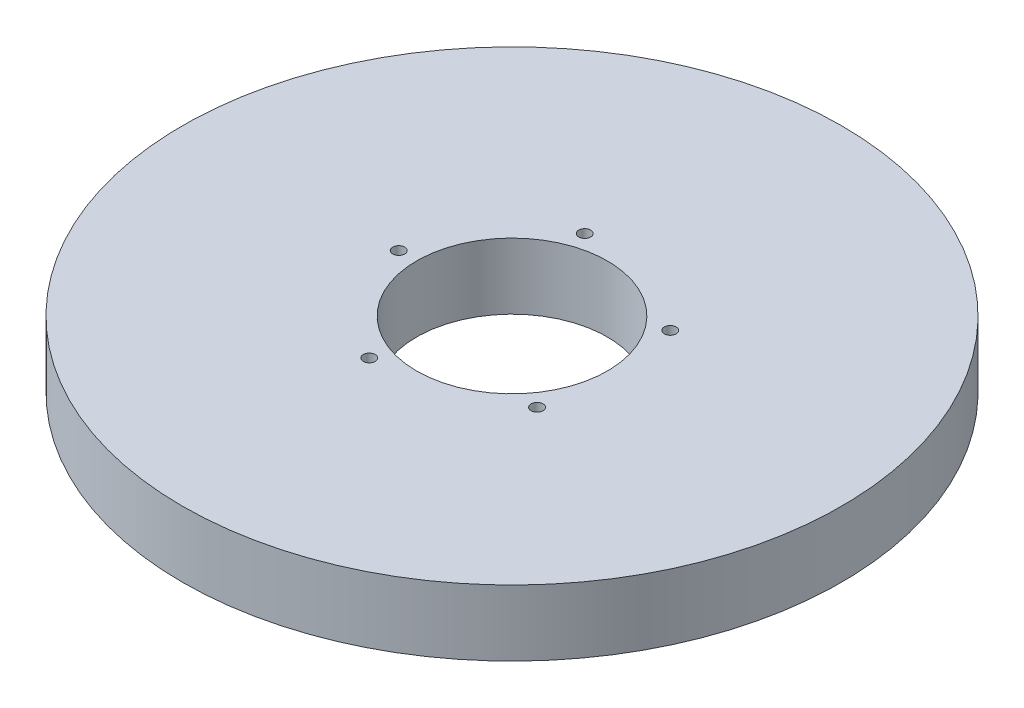
ISO-10303-21;
HEADER;
FILE_DESCRIPTION(('STEP AP214'),'2;1');
FILE_NAME('part.step','',(''),(''),'','','');
FILE_SCHEMA(('AUTOMOTIVE_DESIGN { 1 0 10303 214 1 1 1 1 }'));
ENDSEC;
DATA;
#1=APPLICATION_CONTEXT('core data for automotive mechanical design processes');
#2=APPLICATION_PROTOCOL_DEFINITION('international standard','automotive_design',2000,#1);
#3=PRODUCT_CONTEXT('',#1,'mechanical');
#4=PRODUCT('Part','Part','',(#3));
#5=PRODUCT_RELATED_PRODUCT_CATEGORY('part','',(#4));
#6=PRODUCT_DEFINITION_FORMATION('','',#4);
#7=PRODUCT_DEFINITION_CONTEXT('part definition',#1,'design');
#8=PRODUCT_DEFINITION('design','',#6,#7);
#9=PRODUCT_DEFINITION_SHAPE('','',#8);
#10=(LENGTH_UNIT() NAMED_UNIT(*) SI_UNIT(.MILLI.,.METRE.));
#11=(NAMED_UNIT(*) PLANE_ANGLE_UNIT() SI_UNIT($,.RADIAN.));
#12=(NAMED_UNIT(*) SI_UNIT($,.STERADIAN.) SOLID_ANGLE_UNIT());
#13=UNCERTAINTY_MEASURE_WITH_UNIT(LENGTH_MEASURE(1.E-05),#10,'distance_accuracy_value','');
#14=(GEOMETRIC_REPRESENTATION_CONTEXT(3) GLOBAL_UNCERTAINTY_ASSIGNED_CONTEXT((#13)) GLOBAL_UNIT_ASSIGNED_CONTEXT((#10,
#11,#12)) REPRESENTATION_CONTEXT('',''));
#15=CARTESIAN_POINT('',(0.,0.,0.));
#16=DIRECTION('',(0.,0.,1.));
#17=DIRECTION('',(1.,0.,0.));
#18=AXIS2_PLACEMENT_3D('',#15,#16,#17);
#19=CARTESIAN_POINT('',(0.,19.,0.));
#20=DIRECTION('',(0.,-1.,0.));
#21=DIRECTION('',(0.,0.,-1.));
#22=AXIS2_PLACEMENT_3D('',#19,#20,#21);
#23=CYLINDRICAL_SURFACE('',#22,95.);
#24=CARTESIAN_POINT('',(0.,19.,0.));
#25=DIRECTION('',(0.,1.,0.));
#26=DIRECTION('',(0.,0.,1.));
#27=AXIS2_PLACEMENT_3D('',#24,#25,#26);
#28=CIRCLE('',#27,95.);
#29=CARTESIAN_POINT('',(0.,19.,95.));
#30=VERTEX_POINT('',#29);
#31=EDGE_CURVE('E10',#30,#30,#28,.T.);
#32=ORIENTED_EDGE('',*,*,#31,.F.);
#33=EDGE_LOOP('',(#32));
#34=FACE_BOUND('',#33,.T.);
#35=CARTESIAN_POINT('',(0.,0.,0.));
#36=DIRECTION('',(0.,1.,0.));
#37=DIRECTION('',(0.,0.,1.));
#38=AXIS2_PLACEMENT_3D('',#35,#36,#37);
#39=CIRCLE('',#38,95.);
#40=CARTESIAN_POINT('',(0.,0.,95.));
#41=VERTEX_POINT('',#40);
#42=EDGE_CURVE('E37',#41,#41,#39,.T.);
#43=ORIENTED_EDGE('',*,*,#42,.T.);
#44=EDGE_LOOP('',(#43));
#45=FACE_BOUND('',#44,.T.);
#46=ADVANCED_FACE('F40',(#34,#45),#23,.T.);
#47=CARTESIAN_POINT('',(0.,19.,0.));
#48=DIRECTION('',(0.,1.,0.));
#49=DIRECTION('',(0.,0.,1.));
#50=AXIS2_PLACEMENT_3D('',#47,#48,#49);
#51=PLANE('',#50);
#52=CARTESIAN_POINT('',(-10.091141222785,19.,31.0573392126761));
#53=DIRECTION('',(0.,1.,0.));
#54=DIRECTION('',(0.951056516295155,0.,0.309016994374945));
#55=AXIS2_PLACEMENT_3D('',#52,#53,#54);
#56=CIRCLE('',#55,1.73045322483191);
#57=CARTESIAN_POINT('',(-8.44538240716461,19.,31.5920786671201));
#58=VERTEX_POINT('',#57);
#59=EDGE_CURVE('E78',#58,#58,#56,.T.);
#60=ORIENTED_EDGE('',*,*,#59,.F.);
#61=EDGE_LOOP('',(#60));
#62=FACE_BOUND('',#61,.T.);
#63=CARTESIAN_POINT('',(26.4189507065265,19.,19.1944912335686));
#64=DIRECTION('',(0.,1.,0.));
#65=DIRECTION('',(0.587785252292469,0.,-0.809016994374951));
#66=AXIS2_PLACEMENT_3D('',#63,#64,#65);
#67=CIRCLE('',#66,1.73045322483191);
#68=CARTESIAN_POINT('',(27.4360855918647,19.,17.7945251667086));
#69=VERTEX_POINT('',#68);
#70=EDGE_CURVE('E71',#69,#69,#67,.T.);
#71=ORIENTED_EDGE('',*,*,#70,.F.);
#72=EDGE_LOOP('',(#71));
#73=FACE_BOUND('',#72,.T.);
#74=CARTESIAN_POINT('',(26.4189507065263,19.,-19.194491233569));
#75=DIRECTION('',(0.,1.,0.));
#76=DIRECTION('',(-0.58778525229248,0.,-0.809016994374942));
#77=AXIS2_PLACEMENT_3D('',#74,#75,#76);
#78=CIRCLE('',#77,1.73045322483191);
#79=CARTESIAN_POINT('',(25.4018158211881,19.,-20.5944573004289));
#80=VERTEX_POINT('',#79);
#81=EDGE_CURVE('E70',#80,#80,#78,.T.);
#82=ORIENTED_EDGE('',*,*,#81,.F.);
#83=EDGE_LOOP('',(#82));
#84=FACE_BOUND('',#83,.T.);
#85=CARTESIAN_POINT('',(-10.0911412227854,19.,-31.057339212676));
#86=DIRECTION('',(0.,1.,0.));
#87=DIRECTION('',(-0.95105651629515,0.,0.309016994374958));
#88=AXIS2_PLACEMENT_3D('',#85,#86,#87);
#89=CIRCLE('',#88,1.73045322483191);
#90=CARTESIAN_POINT('',(-11.7369000384057,19.,-30.522599758232));
#91=VERTEX_POINT('',#90);
#92=EDGE_CURVE('E61',#91,#91,#89,.T.);
#93=ORIENTED_EDGE('',*,*,#92,.F.);
#94=EDGE_LOOP('',(#93));
#95=FACE_BOUND('',#94,.T.);
#96=CARTESIAN_POINT('',(-32.6556189674828,19.,0.));
#97=DIRECTION('',(0.,1.,0.));
#98=DIRECTION('',(0.,0.,1.));
#99=AXIS2_PLACEMENT_3D('',#96,#97,#98);
#100=CIRCLE('',#99,1.73045322483191);
#101=CARTESIAN_POINT('',(-32.6556189674828,19.,1.73045322483191));
#102=VERTEX_POINT('',#101);
#103=EDGE_CURVE('E54',#102,#102,#100,.T.);
#104=ORIENTED_EDGE('',*,*,#103,.F.);
#105=EDGE_LOOP('',(#104));
#106=FACE_BOUND('',#105,.T.);
#107=CARTESIAN_POINT('',(0.,19.,0.));
#108=DIRECTION('',(0.,1.,0.));
#109=DIRECTION('',(0.,0.,1.));
#110=AXIS2_PLACEMENT_3D('',#107,#108,#109);
#111=CIRCLE('',#110,27.5);
#112=CARTESIAN_POINT('',(0.,19.,27.5));
#113=VERTEX_POINT('',#112);
#114=EDGE_CURVE('E50',#113,#113,#111,.T.);
#115=ORIENTED_EDGE('',*,*,#114,.F.);
#116=EDGE_LOOP('',(#115));
#117=FACE_BOUND('',#116,.T.);
#118=ORIENTED_EDGE('',*,*,#31,.T.);
#119=EDGE_LOOP('',(#118));
#120=FACE_BOUND('',#119,.T.);
#121=ADVANCED_FACE('F94',(#62,#73,#84,#95,#106,#117,#120),#51,.T.);
#122=CARTESIAN_POINT('',(0.,0.,0.));
#123=DIRECTION('',(0.,1.,0.));
#124=DIRECTION('',(0.,0.,1.));
#125=AXIS2_PLACEMENT_3D('',#122,#123,#124);
#126=PLANE('',#125);
#127=CARTESIAN_POINT('',(0.,0.,0.));
#128=DIRECTION('',(0.,1.,0.));
#129=DIRECTION('',(0.,0.,1.));
#130=AXIS2_PLACEMENT_3D('',#127,#128,#129);
#131=CIRCLE('',#130,27.5);
#132=CARTESIAN_POINT('',(0.,0.,27.5));
#133=VERTEX_POINT('',#132);
#134=EDGE_CURVE('E47',#133,#133,#131,.T.);
#135=ORIENTED_EDGE('',*,*,#134,.T.);
#136=EDGE_LOOP('',(#135));
#137=FACE_BOUND('',#136,.T.);
#138=ORIENTED_EDGE('',*,*,#42,.F.);
#139=EDGE_LOOP('',(#138));
#140=FACE_BOUND('',#139,.T.);
#141=ADVANCED_FACE('F100',(#137,#140),#126,.F.);
#142=CARTESIAN_POINT('',(0.,19.,0.));
#143=DIRECTION('',(0.,-1.,0.));
#144=DIRECTION('',(0.,0.,-1.));
#145=AXIS2_PLACEMENT_3D('',#142,#143,#144);
#146=CYLINDRICAL_SURFACE('',#145,27.5);
#147=ORIENTED_EDGE('',*,*,#114,.T.);
#148=EDGE_LOOP('',(#147));
#149=FACE_BOUND('',#148,.T.);
#150=ORIENTED_EDGE('',*,*,#134,.F.);
#151=EDGE_LOOP('',(#150));
#152=FACE_BOUND('',#151,.T.);
#153=ADVANCED_FACE('F108',(#149,#152),#146,.F.);
#154=CARTESIAN_POINT('',(-32.6556189674828,4.75525767914453,0.));
#155=DIRECTION('',(0.,1.,0.));
#156=DIRECTION('',(0.,0.,1.));
#157=AXIS2_PLACEMENT_3D('',#154,#155,#156);
#158=CYLINDRICAL_SURFACE('',#157,1.73045322483191);
#159=CARTESIAN_POINT('',(-32.6556189674828,4.75525767914453,0.));
#160=DIRECTION('',(0.,1.,0.));
#161=DIRECTION('',(0.,0.,1.));
#162=AXIS2_PLACEMENT_3D('',#159,#160,#161);
#163=CIRCLE('',#162,1.73045322483191);
#164=CARTESIAN_POINT('',(-32.6556189674828,4.75525767914453,1.73045322483191));
#165=VERTEX_POINT('',#164);
#166=EDGE_CURVE('E55',#165,#165,#163,.T.);
#167=ORIENTED_EDGE('',*,*,#166,.F.);
#168=EDGE_LOOP('',(#167));
#169=FACE_BOUND('',#168,.T.);
#170=ORIENTED_EDGE('',*,*,#103,.T.);
#171=EDGE_LOOP('',(#170));
#172=FACE_BOUND('',#171,.T.);
#173=ADVANCED_FACE('F115',(#169,#172),#158,.F.);
#174=CARTESIAN_POINT('',(-32.6556189674828,4.75525767914453,0.));
#175=DIRECTION('',(0.,1.,0.));
#176=DIRECTION('',(0.,0.,1.));
#177=AXIS2_PLACEMENT_3D('',#174,#175,#176);
#178=PLANE('',#177);
#179=ORIENTED_EDGE('',*,*,#166,.T.);
#180=EDGE_LOOP('',(#179));
#181=FACE_BOUND('',#180,.T.);
#182=ADVANCED_FACE('F142',(#181),#178,.T.);
#183=CARTESIAN_POINT('',(-10.0911412227854,4.75525767914453,-31.057339212676));
#184=DIRECTION('',(0.,1.,0.));
#185=DIRECTION('',(0.,0.,1.));
#186=AXIS2_PLACEMENT_3D('',#183,#184,#185);
#187=CYLINDRICAL_SURFACE('',#186,1.73045322483191);
#188=CARTESIAN_POINT('',(-10.0911412227854,4.75525767914453,-31.057339212676));
#189=DIRECTION('',(0.,1.,0.));
#190=DIRECTION('',(-0.95105651629515,0.,0.309016994374958));
#191=AXIS2_PLACEMENT_3D('',#188,#189,#190);
#192=CIRCLE('',#191,1.73045322483191);
#193=CARTESIAN_POINT('',(-11.7369000384057,4.75525767914453,-30.522599758232));
#194=VERTEX_POINT('',#193);
#195=EDGE_CURVE('E63',#194,#194,#192,.T.);
#196=ORIENTED_EDGE('',*,*,#195,.F.);
#197=EDGE_LOOP('',(#196));
#198=FACE_BOUND('',#197,.T.);
#199=ORIENTED_EDGE('',*,*,#92,.T.);
#200=EDGE_LOOP('',(#199));
#201=FACE_BOUND('',#200,.T.);
#202=ADVANCED_FACE('F147',(#198,#201),#187,.F.);
#203=CARTESIAN_POINT('',(-10.0911412227854,4.75525767914453,-31.057339212676));
#204=DIRECTION('',(0.,1.,0.));
#205=DIRECTION('',(-0.95105651629515,0.,0.309016994374958));
#206=AXIS2_PLACEMENT_3D('',#203,#204,#205);
#207=PLANE('',#206);
#208=ORIENTED_EDGE('',*,*,#195,.T.);
#209=EDGE_LOOP('',(#208));
#210=FACE_BOUND('',#209,.T.);
#211=ADVANCED_FACE('F163',(#210),#207,.T.);
#212=CARTESIAN_POINT('',(26.4189507065263,4.75525767914453,-19.194491233569));
#213=DIRECTION('',(0.,1.,0.));
#214=DIRECTION('',(0.,0.,1.));
#215=AXIS2_PLACEMENT_3D('',#212,#213,#214);
#216=CYLINDRICAL_SURFACE('',#215,1.73045322483191);
#217=CARTESIAN_POINT('',(26.4189507065263,4.75525767914453,-19.194491233569));
#218=DIRECTION('',(0.,1.,0.));
#219=DIRECTION('',(-0.58778525229248,0.,-0.809016994374942));
#220=AXIS2_PLACEMENT_3D('',#217,#218,#219);
#221=CIRCLE('',#220,1.73045322483191);
#222=CARTESIAN_POINT('',(25.4018158211881,4.75525767914453,-20.5944573004289));
#223=VERTEX_POINT('',#222);
#224=EDGE_CURVE('E69',#223,#223,#221,.T.);
#225=ORIENTED_EDGE('',*,*,#224,.F.);
#226=EDGE_LOOP('',(#225));
#227=FACE_BOUND('',#226,.T.);
#228=ORIENTED_EDGE('',*,*,#81,.T.);
#229=EDGE_LOOP('',(#228));
#230=FACE_BOUND('',#229,.T.);
#231=ADVANCED_FACE('F172',(#227,#230),#216,.F.);
#232=CARTESIAN_POINT('',(26.4189507065263,4.75525767914453,-19.194491233569));
#233=DIRECTION('',(0.,1.,0.));
#234=DIRECTION('',(-0.58778525229248,0.,-0.809016994374942));
#235=AXIS2_PLACEMENT_3D('',#232,#233,#234);
#236=PLANE('',#235);
#237=ORIENTED_EDGE('',*,*,#224,.T.);
#238=EDGE_LOOP('',(#237));
#239=FACE_BOUND('',#238,.T.);
#240=ADVANCED_FACE('F185',(#239),#236,.T.);
#241=CARTESIAN_POINT('',(26.4189507065265,4.75525767914453,19.1944912335686));
#242=DIRECTION('',(0.,1.,0.));
#243=DIRECTION('',(0.,0.,1.));
#244=AXIS2_PLACEMENT_3D('',#241,#242,#243);
#245=CYLINDRICAL_SURFACE('',#244,1.73045322483191);
#246=CARTESIAN_POINT('',(26.4189507065265,4.75525767914453,19.1944912335686));
#247=DIRECTION('',(0.,1.,0.));
#248=DIRECTION('',(0.587785252292469,0.,-0.809016994374951));
#249=AXIS2_PLACEMENT_3D('',#246,#247,#248);
#250=CIRCLE('',#249,1.73045322483191);
#251=CARTESIAN_POINT('',(27.4360855918647,4.75525767914453,17.7945251667086));
#252=VERTEX_POINT('',#251);
#253=EDGE_CURVE('E76',#252,#252,#250,.T.);
#254=ORIENTED_EDGE('',*,*,#253,.F.);
#255=EDGE_LOOP('',(#254));
#256=FACE_BOUND('',#255,.T.);
#257=ORIENTED_EDGE('',*,*,#70,.T.);
#258=EDGE_LOOP('',(#257));
#259=FACE_BOUND('',#258,.T.);
#260=ADVANCED_FACE('F191',(#256,#259),#245,.F.);
#261=CARTESIAN_POINT('',(26.4189507065265,4.75525767914453,19.1944912335686));
#262=DIRECTION('',(0.,1.,0.));
#263=DIRECTION('',(0.587785252292469,0.,-0.809016994374951));
#264=AXIS2_PLACEMENT_3D('',#261,#262,#263);
#265=PLANE('',#264);
#266=ORIENTED_EDGE('',*,*,#253,.T.);
#267=EDGE_LOOP('',(#266));
#268=FACE_BOUND('',#267,.T.);
#269=ADVANCED_FACE('F89',(#268),#265,.T.);
#270=CARTESIAN_POINT('',(-10.091141222785,4.75525767914453,31.0573392126761));
#271=DIRECTION('',(0.,1.,0.));
#272=DIRECTION('',(0.,0.,1.));
#273=AXIS2_PLACEMENT_3D('',#270,#271,#272);
#274=CYLINDRICAL_SURFACE('',#273,1.73045322483191);
#275=CARTESIAN_POINT('',(-10.091141222785,4.75525767914453,31.0573392126761));
#276=DIRECTION('',(0.,1.,0.));
#277=DIRECTION('',(0.951056516295155,0.,0.309016994374945));
#278=AXIS2_PLACEMENT_3D('',#275,#276,#277);
#279=CIRCLE('',#278,1.73045322483191);
#280=CARTESIAN_POINT('',(-8.44538240716461,4.75525767914453,31.5920786671201));
#281=VERTEX_POINT('',#280);
#282=EDGE_CURVE('E59',#281,#281,#279,.T.);
#283=ORIENTED_EDGE('',*,*,#282,.F.);
#284=EDGE_LOOP('',(#283));
#285=FACE_BOUND('',#284,.T.);
#286=ORIENTED_EDGE('',*,*,#59,.T.);
#287=EDGE_LOOP('',(#286));
#288=FACE_BOUND('',#287,.T.);
#289=ADVANCED_FACE('F87',(#285,#288),#274,.F.);
#290=CARTESIAN_POINT('',(-10.091141222785,4.75525767914453,31.0573392126761));
#291=DIRECTION('',(0.,1.,0.));
#292=DIRECTION('',(0.951056516295155,0.,0.309016994374945));
#293=AXIS2_PLACEMENT_3D('',#290,#291,#292);
#294=PLANE('',#293);
#295=ORIENTED_EDGE('',*,*,#282,.T.);
#296=EDGE_LOOP('',(#295));
#297=FACE_BOUND('',#296,.T.);
#298=ADVANCED_FACE('F84',(#297),#294,.T.);
#299=CLOSED_SHELL('',(#46,#121,#141,#153,#173,#182,#202,#211,#231,#240,#260,#269,#289,#298));
#300=MANIFOLD_SOLID_BREP('B2',#299);
#301=ADVANCED_BREP_SHAPE_REPRESENTATION('',(#18,#300),#14);
#302=SHAPE_DEFINITION_REPRESENTATION(#9,#301);
ENDSEC;
END-ISO-10303-21;
